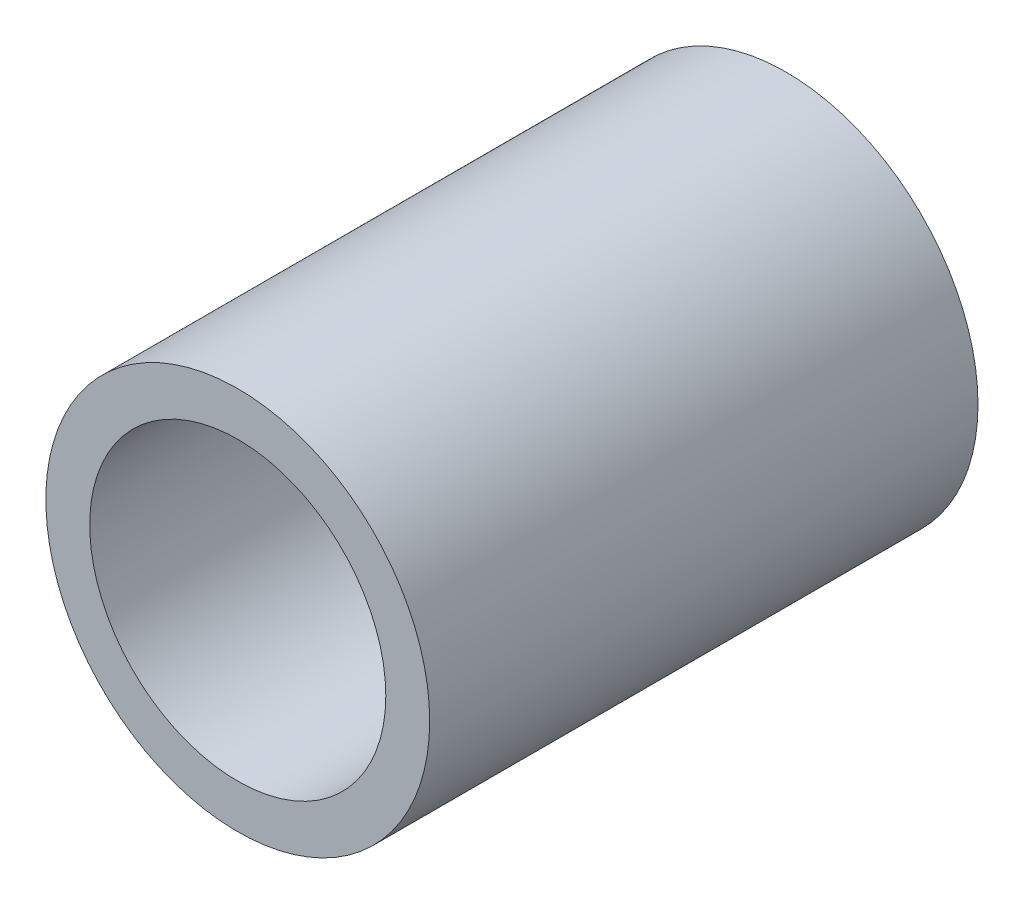
ISO-10303-21;
HEADER;
FILE_DESCRIPTION(('STEP AP214'),'2;1');
FILE_NAME('part.step','',(''),(''),'','','');
FILE_SCHEMA(('AUTOMOTIVE_DESIGN { 1 0 10303 214 1 1 1 1 }'));
ENDSEC;
DATA;
#1=APPLICATION_CONTEXT('core data for automotive mechanical design processes');
#2=APPLICATION_PROTOCOL_DEFINITION('international standard','automotive_design',2000,#1);
#3=PRODUCT_CONTEXT('',#1,'mechanical');
#4=PRODUCT('Part','Part','',(#3));
#5=PRODUCT_RELATED_PRODUCT_CATEGORY('part','',(#4));
#6=PRODUCT_DEFINITION_FORMATION('','',#4);
#7=PRODUCT_DEFINITION_CONTEXT('part definition',#1,'design');
#8=PRODUCT_DEFINITION('design','',#6,#7);
#9=PRODUCT_DEFINITION_SHAPE('','',#8);
#10=(LENGTH_UNIT() NAMED_UNIT(*) SI_UNIT(.MILLI.,.METRE.));
#11=(NAMED_UNIT(*) PLANE_ANGLE_UNIT() SI_UNIT($,.RADIAN.));
#12=(NAMED_UNIT(*) SI_UNIT($,.STERADIAN.) SOLID_ANGLE_UNIT());
#13=UNCERTAINTY_MEASURE_WITH_UNIT(LENGTH_MEASURE(1.E-05),#10,'distance_accuracy_value','');
#14=(GEOMETRIC_REPRESENTATION_CONTEXT(3) GLOBAL_UNCERTAINTY_ASSIGNED_CONTEXT((#13)) GLOBAL_UNIT_ASSIGNED_CONTEXT((#10,
#11,#12)) REPRESENTATION_CONTEXT('',''));
#15=CARTESIAN_POINT('',(0.,0.,0.));
#16=DIRECTION('',(0.,0.,1.));
#17=DIRECTION('',(1.,0.,0.));
#18=AXIS2_PLACEMENT_3D('',#15,#16,#17);
#19=CARTESIAN_POINT('',(0.,0.,0.));
#20=DIRECTION('',(0.,0.,1.));
#21=DIRECTION('',(1.,0.,0.));
#22=AXIS2_PLACEMENT_3D('',#19,#20,#21);
#23=CYLINDRICAL_SURFACE('',#22,2.7);
#24=CARTESIAN_POINT('',(0.,0.,0.));
#25=DIRECTION('',(0.,0.,1.));
#26=DIRECTION('',(1.,0.,0.));
#27=AXIS2_PLACEMENT_3D('',#24,#25,#26);
#28=CIRCLE('',#27,2.7);
#29=CARTESIAN_POINT('',(2.7,0.,0.));
#30=VERTEX_POINT('',#29);
#31=EDGE_CURVE('E27',#30,#30,#28,.F.);
#32=ORIENTED_EDGE('',*,*,#31,.T.);
#33=EDGE_LOOP('',(#32));
#34=FACE_BOUND('',#33,.T.);
#35=CARTESIAN_POINT('',(0.,0.,10.));
#36=DIRECTION('',(0.,0.,1.));
#37=DIRECTION('',(1.,0.,0.));
#38=AXIS2_PLACEMENT_3D('',#35,#36,#37);
#39=CIRCLE('',#38,2.7);
#40=CARTESIAN_POINT('',(2.7,0.,10.));
#41=VERTEX_POINT('',#40);
#42=EDGE_CURVE('E18',#41,#41,#39,.F.);
#43=ORIENTED_EDGE('',*,*,#42,.F.);
#44=EDGE_LOOP('',(#43));
#45=FACE_BOUND('',#44,.T.);
#46=ADVANCED_FACE('F15',(#34,#45),#23,.F.);
#47=CARTESIAN_POINT('',(0.,0.,10.));
#48=DIRECTION('',(0.,0.,1.));
#49=DIRECTION('',(1.,0.,0.));
#50=AXIS2_PLACEMENT_3D('',#47,#48,#49);
#51=PLANE('',#50);
#52=ORIENTED_EDGE('',*,*,#42,.T.);
#53=EDGE_LOOP('',(#52));
#54=FACE_BOUND('',#53,.T.);
#55=CARTESIAN_POINT('',(0.,0.,10.));
#56=DIRECTION('',(0.,0.,1.));
#57=DIRECTION('',(1.,0.,0.));
#58=AXIS2_PLACEMENT_3D('',#55,#56,#57);
#59=CIRCLE('',#58,3.5);
#60=CARTESIAN_POINT('',(3.5,0.,10.));
#61=VERTEX_POINT('',#60);
#62=EDGE_CURVE('E22',#61,#61,#59,.F.);
#63=ORIENTED_EDGE('',*,*,#62,.F.);
#64=EDGE_LOOP('',(#63));
#65=FACE_BOUND('',#64,.T.);
#66=ADVANCED_FACE('F35',(#54,#65),#51,.T.);
#67=CARTESIAN_POINT('',(0.,0.,0.));
#68=DIRECTION('',(0.,0.,1.));
#69=DIRECTION('',(1.,0.,0.));
#70=AXIS2_PLACEMENT_3D('',#67,#68,#69);
#71=PLANE('',#70);
#72=ORIENTED_EDGE('',*,*,#31,.F.);
#73=EDGE_LOOP('',(#72));
#74=FACE_BOUND('',#73,.T.);
#75=CARTESIAN_POINT('',(0.,0.,0.));
#76=DIRECTION('',(0.,0.,1.));
#77=DIRECTION('',(1.,0.,0.));
#78=AXIS2_PLACEMENT_3D('',#75,#76,#77);
#79=CIRCLE('',#78,3.5);
#80=CARTESIAN_POINT('',(3.5,0.,0.));
#81=VERTEX_POINT('',#80);
#82=EDGE_CURVE('E10',#81,#81,#79,.T.);
#83=ORIENTED_EDGE('',*,*,#82,.F.);
#84=EDGE_LOOP('',(#83));
#85=FACE_BOUND('',#84,.T.);
#86=ADVANCED_FACE('F43',(#74,#85),#71,.F.);
#87=CARTESIAN_POINT('',(0.,0.,0.));
#88=DIRECTION('',(0.,0.,1.));
#89=DIRECTION('',(1.,0.,0.));
#90=AXIS2_PLACEMENT_3D('',#87,#88,#89);
#91=CYLINDRICAL_SURFACE('',#90,3.5);
#92=ORIENTED_EDGE('',*,*,#82,.T.);
#93=EDGE_LOOP('',(#92));
#94=FACE_BOUND('',#93,.T.);
#95=ORIENTED_EDGE('',*,*,#62,.T.);
#96=EDGE_LOOP('',(#95));
#97=FACE_BOUND('',#96,.T.);
#98=ADVANCED_FACE('F44',(#94,#97),#91,.T.);
#99=CLOSED_SHELL('',(#46,#66,#86,#98));
#100=MANIFOLD_SOLID_BREP('B1',#99);
#101=ADVANCED_BREP_SHAPE_REPRESENTATION('',(#18,#100),#14);
#102=SHAPE_DEFINITION_REPRESENTATION(#9,#101);
ENDSEC;
END-ISO-10303-21;
